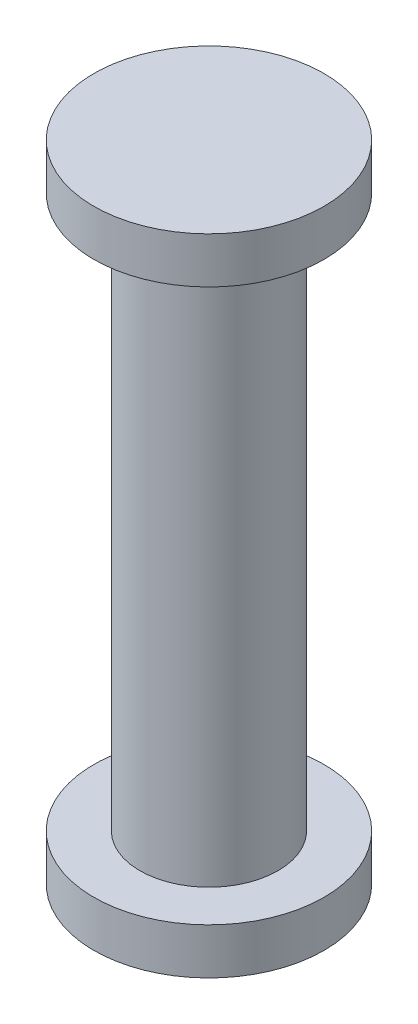
ISO-10303-21;
HEADER;
FILE_DESCRIPTION(('STEP AP214'),'2;1');
FILE_NAME('part.step','',(''),(''),'','','');
FILE_SCHEMA(('AUTOMOTIVE_DESIGN { 1 0 10303 214 1 1 1 1 }'));
ENDSEC;
DATA;
#1=APPLICATION_CONTEXT('core data for automotive mechanical design processes');
#2=APPLICATION_PROTOCOL_DEFINITION('international standard','automotive_design',2000,#1);
#3=PRODUCT_CONTEXT('',#1,'mechanical');
#4=PRODUCT('Part','Part','',(#3));
#5=PRODUCT_RELATED_PRODUCT_CATEGORY('part','',(#4));
#6=PRODUCT_DEFINITION_FORMATION('','',#4);
#7=PRODUCT_DEFINITION_CONTEXT('part definition',#1,'design');
#8=PRODUCT_DEFINITION('design','',#6,#7);
#9=PRODUCT_DEFINITION_SHAPE('','',#8);
#10=(LENGTH_UNIT() NAMED_UNIT(*) SI_UNIT(.MILLI.,.METRE.));
#11=(NAMED_UNIT(*) PLANE_ANGLE_UNIT() SI_UNIT($,.RADIAN.));
#12=(NAMED_UNIT(*) SI_UNIT($,.STERADIAN.) SOLID_ANGLE_UNIT());
#13=UNCERTAINTY_MEASURE_WITH_UNIT(LENGTH_MEASURE(1.E-05),#10,'distance_accuracy_value','');
#14=(GEOMETRIC_REPRESENTATION_CONTEXT(3) GLOBAL_UNCERTAINTY_ASSIGNED_CONTEXT((#13)) GLOBAL_UNIT_ASSIGNED_CONTEXT((#10,
#11,#12)) REPRESENTATION_CONTEXT('',''));
#15=CARTESIAN_POINT('',(0.,0.,0.));
#16=DIRECTION('',(0.,0.,1.));
#17=DIRECTION('',(1.,0.,0.));
#18=AXIS2_PLACEMENT_3D('',#15,#16,#17);
#19=CARTESIAN_POINT('',(-2.5,0.,0.));
#20=DIRECTION('',(0.,1.,0.));
#21=DIRECTION('',(-1.,0.,0.));
#22=AXIS2_PLACEMENT_3D('',#19,#20,#21);
#23=PLANE('',#22);
#24=CARTESIAN_POINT('',(0.,0.,0.));
#25=DIRECTION('',(0.,-1.,0.));
#26=DIRECTION('',(1.,0.,0.));
#27=AXIS2_PLACEMENT_3D('',#24,#25,#26);
#28=CIRCLE('',#27,2.5);
#29=CARTESIAN_POINT('',(2.5,0.,0.));
#30=VERTEX_POINT('',#29);
#31=EDGE_CURVE('E54',#30,#30,#28,.T.);
#32=ORIENTED_EDGE('',*,*,#31,.T.);
#33=EDGE_LOOP('',(#32));
#34=FACE_BOUND('',#33,.T.);
#35=ADVANCED_FACE('F32',(#34),#23,.F.);
#36=CARTESIAN_POINT('',(0.,14.,0.));
#37=DIRECTION('',(0.,-1.,0.));
#38=DIRECTION('',(1.,0.,0.));
#39=AXIS2_PLACEMENT_3D('',#36,#37,#38);
#40=PLANE('',#39);
#41=CARTESIAN_POINT('',(0.,14.,0.));
#42=DIRECTION('',(0.,-1.,0.));
#43=DIRECTION('',(1.,0.,0.));
#44=AXIS2_PLACEMENT_3D('',#41,#42,#43);
#45=CIRCLE('',#44,2.5);
#46=CARTESIAN_POINT('',(2.5,14.,0.));
#47=VERTEX_POINT('',#46);
#48=EDGE_CURVE('E10',#47,#47,#45,.T.);
#49=ORIENTED_EDGE('',*,*,#48,.F.);
#50=EDGE_LOOP('',(#49));
#51=FACE_BOUND('',#50,.T.);
#52=ADVANCED_FACE('F84',(#51),#40,.F.);
#53=CARTESIAN_POINT('',(0.,0.,0.));
#54=DIRECTION('',(0.,-1.,0.));
#55=DIRECTION('',(1.,0.,0.));
#56=AXIS2_PLACEMENT_3D('',#53,#54,#55);
#57=CYLINDRICAL_SURFACE('',#56,2.5);
#58=CARTESIAN_POINT('',(0.,13.,0.));
#59=DIRECTION('',(0.,-1.,0.));
#60=DIRECTION('',(1.,0.,0.));
#61=AXIS2_PLACEMENT_3D('',#58,#59,#60);
#62=CIRCLE('',#61,2.5);
#63=CARTESIAN_POINT('',(2.5,13.,0.));
#64=VERTEX_POINT('',#63);
#65=EDGE_CURVE('E38',#64,#64,#62,.T.);
#66=ORIENTED_EDGE('',*,*,#65,.F.);
#67=EDGE_LOOP('',(#66));
#68=FACE_BOUND('',#67,.T.);
#69=ORIENTED_EDGE('',*,*,#48,.T.);
#70=EDGE_LOOP('',(#69));
#71=FACE_BOUND('',#70,.T.);
#72=ADVANCED_FACE('F79',(#68,#71),#57,.T.);
#73=CARTESIAN_POINT('',(-2.5,13.,0.));
#74=DIRECTION('',(0.,1.,0.));
#75=DIRECTION('',(-1.,0.,0.));
#76=AXIS2_PLACEMENT_3D('',#73,#74,#75);
#77=PLANE('',#76);
#78=CARTESIAN_POINT('',(0.,13.,0.));
#79=DIRECTION('',(0.,-1.,0.));
#80=DIRECTION('',(1.,0.,0.));
#81=AXIS2_PLACEMENT_3D('',#78,#79,#80);
#82=CIRCLE('',#81,1.5);
#83=CARTESIAN_POINT('',(1.5,13.,0.));
#84=VERTEX_POINT('',#83);
#85=EDGE_CURVE('E42',#84,#84,#82,.T.);
#86=ORIENTED_EDGE('',*,*,#85,.F.);
#87=EDGE_LOOP('',(#86));
#88=FACE_BOUND('',#87,.T.);
#89=ORIENTED_EDGE('',*,*,#65,.T.);
#90=EDGE_LOOP('',(#89));
#91=FACE_BOUND('',#90,.T.);
#92=ADVANCED_FACE('F74',(#88,#91),#77,.F.);
#93=CARTESIAN_POINT('',(0.,0.,0.));
#94=DIRECTION('',(0.,-1.,0.));
#95=DIRECTION('',(1.,0.,0.));
#96=AXIS2_PLACEMENT_3D('',#93,#94,#95);
#97=CYLINDRICAL_SURFACE('',#96,1.5);
#98=CARTESIAN_POINT('',(0.,0.999999999999967,0.));
#99=DIRECTION('',(0.,-1.,0.));
#100=DIRECTION('',(1.,0.,0.));
#101=AXIS2_PLACEMENT_3D('',#98,#99,#100);
#102=CIRCLE('',#101,1.49999999999999);
#103=CARTESIAN_POINT('',(1.49999999999999,0.999999999999967,0.));
#104=VERTEX_POINT('',#103);
#105=EDGE_CURVE('E46',#104,#104,#102,.T.);
#106=ORIENTED_EDGE('',*,*,#105,.F.);
#107=EDGE_LOOP('',(#106));
#108=FACE_BOUND('',#107,.T.);
#109=ORIENTED_EDGE('',*,*,#85,.T.);
#110=EDGE_LOOP('',(#109));
#111=FACE_BOUND('',#110,.T.);
#112=ADVANCED_FACE('F68',(#108,#111),#97,.T.);
#113=CARTESIAN_POINT('',(-1.49999999999999,0.999999999999966,0.));
#114=DIRECTION('',(0.,-1.,0.));
#115=DIRECTION('',(1.,0.,0.));
#116=AXIS2_PLACEMENT_3D('',#113,#114,#115);
#117=PLANE('',#116);
#118=CARTESIAN_POINT('',(0.,0.999999999999967,0.));
#119=DIRECTION('',(0.,-1.,0.));
#120=DIRECTION('',(1.,0.,0.));
#121=AXIS2_PLACEMENT_3D('',#118,#119,#120);
#122=CIRCLE('',#121,2.49999999999999);
#123=CARTESIAN_POINT('',(2.49999999999999,0.999999999999968,0.));
#124=VERTEX_POINT('',#123);
#125=EDGE_CURVE('E51',#124,#124,#122,.T.);
#126=ORIENTED_EDGE('',*,*,#125,.F.);
#127=EDGE_LOOP('',(#126));
#128=FACE_BOUND('',#127,.T.);
#129=ORIENTED_EDGE('',*,*,#105,.T.);
#130=EDGE_LOOP('',(#129));
#131=FACE_BOUND('',#130,.T.);
#132=ADVANCED_FACE('F62',(#128,#131),#117,.F.);
#133=CARTESIAN_POINT('',(0.,0.,0.));
#134=DIRECTION('',(0.,-1.,0.));
#135=DIRECTION('',(1.,0.,0.));
#136=AXIS2_PLACEMENT_3D('',#133,#134,#135);
#137=CYLINDRICAL_SURFACE('',#136,2.49999999999999);
#138=ORIENTED_EDGE('',*,*,#31,.F.);
#139=EDGE_LOOP('',(#138));
#140=FACE_BOUND('',#139,.T.);
#141=ORIENTED_EDGE('',*,*,#125,.T.);
#142=EDGE_LOOP('',(#141));
#143=FACE_BOUND('',#142,.T.);
#144=ADVANCED_FACE('F59',(#140,#143),#137,.T.);
#145=CLOSED_SHELL('',(#35,#52,#72,#92,#112,#132,#144));
#146=MANIFOLD_SOLID_BREP('B2',#145);
#147=ADVANCED_BREP_SHAPE_REPRESENTATION('',(#18,#146),#14);
#148=SHAPE_DEFINITION_REPRESENTATION(#9,#147);
ENDSEC;
END-ISO-10303-21;
